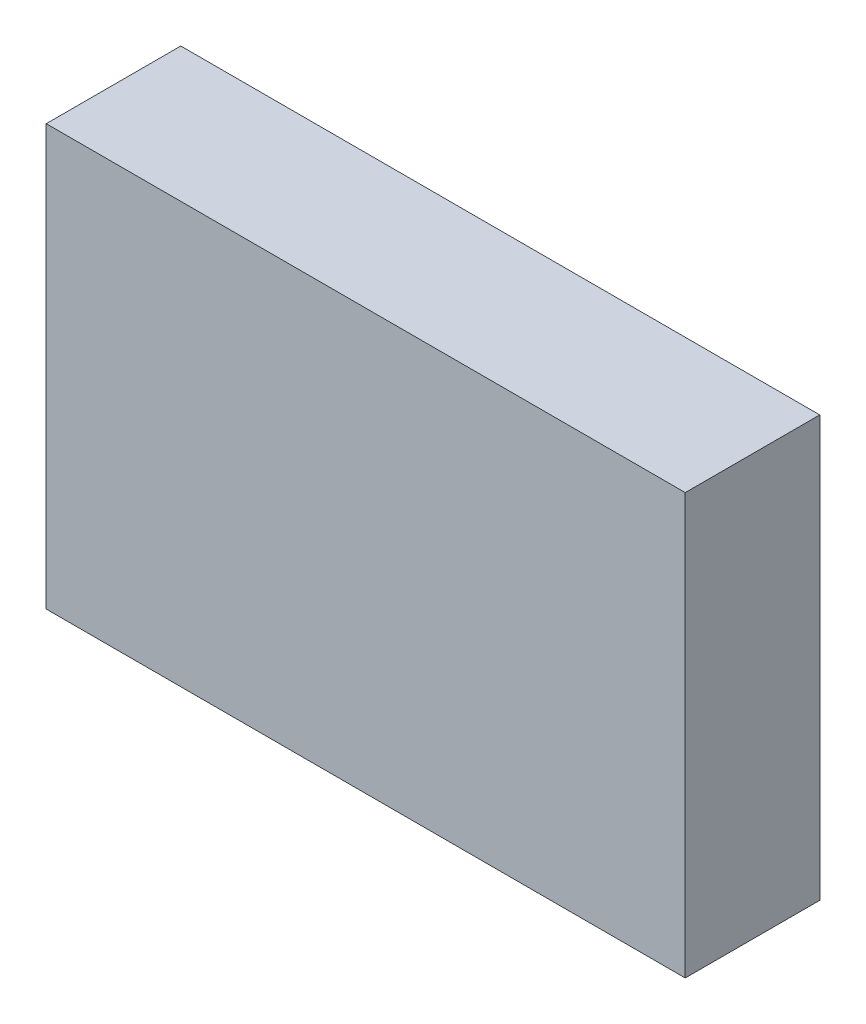
ISO-10303-21;
HEADER;
FILE_DESCRIPTION(('STEP AP214'),'2;1');
FILE_NAME('part.step','',(''),(''),'','','');
FILE_SCHEMA(('AUTOMOTIVE_DESIGN { 1 0 10303 214 1 1 1 1 }'));
ENDSEC;
DATA;
#1=APPLICATION_CONTEXT('core data for automotive mechanical design processes');
#2=APPLICATION_PROTOCOL_DEFINITION('international standard','automotive_design',2000,#1);
#3=PRODUCT_CONTEXT('',#1,'mechanical');
#4=PRODUCT('Part','Part','',(#3));
#5=PRODUCT_RELATED_PRODUCT_CATEGORY('part','',(#4));
#6=PRODUCT_DEFINITION_FORMATION('','',#4);
#7=PRODUCT_DEFINITION_CONTEXT('part definition',#1,'design');
#8=PRODUCT_DEFINITION('design','',#6,#7);
#9=PRODUCT_DEFINITION_SHAPE('','',#8);
#10=(LENGTH_UNIT() NAMED_UNIT(*) SI_UNIT(.MILLI.,.METRE.));
#11=(NAMED_UNIT(*) PLANE_ANGLE_UNIT() SI_UNIT($,.RADIAN.));
#12=(NAMED_UNIT(*) SI_UNIT($,.STERADIAN.) SOLID_ANGLE_UNIT());
#13=UNCERTAINTY_MEASURE_WITH_UNIT(LENGTH_MEASURE(1.E-05),#10,'distance_accuracy_value','');
#14=(GEOMETRIC_REPRESENTATION_CONTEXT(3) GLOBAL_UNCERTAINTY_ASSIGNED_CONTEXT((#13)) GLOBAL_UNIT_ASSIGNED_CONTEXT((#10,
#11,#12)) REPRESENTATION_CONTEXT('',''));
#15=CARTESIAN_POINT('',(0.,0.,0.));
#16=DIRECTION('',(0.,0.,1.));
#17=DIRECTION('',(1.,0.,0.));
#18=AXIS2_PLACEMENT_3D('',#15,#16,#17);
#19=CARTESIAN_POINT('',(0.95,-0.625,0.));
#20=DIRECTION('',(1.,0.,0.));
#21=DIRECTION('',(0.,1.,0.));
#22=AXIS2_PLACEMENT_3D('',#19,#20,#21);
#23=PLANE('',#22);
#24=DIRECTION('',(0.,-1.,0.));
#25=VECTOR('',#24,1.);
#26=CARTESIAN_POINT('',(0.95,0.625,0.));
#27=LINE('',#26,#25);
#28=CARTESIAN_POINT('',(0.95,0.625,0.));
#29=VERTEX_POINT('',#28);
#30=CARTESIAN_POINT('',(0.95,-0.625,0.));
#31=VERTEX_POINT('',#30);
#32=EDGE_CURVE('E11',#29,#31,#27,.T.);
#33=ORIENTED_EDGE('',*,*,#32,.F.);
#34=DIRECTION('',(0.,0.,1.));
#35=VECTOR('',#34,1.);
#36=CARTESIAN_POINT('',(0.95,0.625,0.));
#37=LINE('',#36,#35);
#38=CARTESIAN_POINT('',(0.95,0.625,0.4));
#39=VERTEX_POINT('',#38);
#40=EDGE_CURVE('E88',#29,#39,#37,.T.);
#41=ORIENTED_EDGE('',*,*,#40,.T.);
#42=DIRECTION('',(0.,1.,0.));
#43=VECTOR('',#42,1.);
#44=CARTESIAN_POINT('',(0.95,-0.625,0.4));
#45=LINE('',#44,#43);
#46=CARTESIAN_POINT('',(0.95,-0.625,0.4));
#47=VERTEX_POINT('',#46);
#48=EDGE_CURVE('E77',#47,#39,#45,.T.);
#49=ORIENTED_EDGE('',*,*,#48,.F.);
#50=DIRECTION('',(0.,0.,1.));
#51=VECTOR('',#50,1.);
#52=CARTESIAN_POINT('',(0.95,-0.625,0.));
#53=LINE('',#52,#51);
#54=EDGE_CURVE('E84',#31,#47,#53,.T.);
#55=ORIENTED_EDGE('',*,*,#54,.F.);
#56=EDGE_LOOP('',(#33,#41,#49,#55));
#57=FACE_BOUND('',#56,.T.);
#58=ADVANCED_FACE('F17',(#57),#23,.T.);
#59=CARTESIAN_POINT('',(-0.95,-0.625,0.));
#60=DIRECTION('',(0.,-1.,0.));
#61=DIRECTION('',(1.,0.,0.));
#62=AXIS2_PLACEMENT_3D('',#59,#60,#61);
#63=PLANE('',#62);
#64=DIRECTION('',(-1.,0.,0.));
#65=VECTOR('',#64,1.);
#66=CARTESIAN_POINT('',(0.95,-0.625,0.));
#67=LINE('',#66,#65);
#68=CARTESIAN_POINT('',(-0.95,-0.625,0.));
#69=VERTEX_POINT('',#68);
#70=EDGE_CURVE('E24',#31,#69,#67,.T.);
#71=ORIENTED_EDGE('',*,*,#70,.F.);
#72=ORIENTED_EDGE('',*,*,#54,.T.);
#73=DIRECTION('',(1.,0.,0.));
#74=VECTOR('',#73,1.);
#75=CARTESIAN_POINT('',(-0.95,-0.625,0.4));
#76=LINE('',#75,#74);
#77=CARTESIAN_POINT('',(-0.95,-0.625,0.4));
#78=VERTEX_POINT('',#77);
#79=EDGE_CURVE('E65',#78,#47,#76,.T.);
#80=ORIENTED_EDGE('',*,*,#79,.F.);
#81=DIRECTION('',(0.,0.,1.));
#82=VECTOR('',#81,1.);
#83=CARTESIAN_POINT('',(-0.95,-0.625,0.));
#84=LINE('',#83,#82);
#85=EDGE_CURVE('E70',#69,#78,#84,.T.);
#86=ORIENTED_EDGE('',*,*,#85,.F.);
#87=EDGE_LOOP('',(#71,#72,#80,#86));
#88=FACE_BOUND('',#87,.T.);
#89=ADVANCED_FACE('F91',(#88),#63,.T.);
#90=CARTESIAN_POINT('',(-0.95,0.625,0.));
#91=DIRECTION('',(-1.,0.,0.));
#92=DIRECTION('',(0.,-1.,0.));
#93=AXIS2_PLACEMENT_3D('',#90,#91,#92);
#94=PLANE('',#93);
#95=DIRECTION('',(0.,1.,0.));
#96=VECTOR('',#95,1.);
#97=CARTESIAN_POINT('',(-0.95,-0.625,0.));
#98=LINE('',#97,#96);
#99=CARTESIAN_POINT('',(-0.95,0.625,0.));
#100=VERTEX_POINT('',#99);
#101=EDGE_CURVE('E86',#69,#100,#98,.T.);
#102=ORIENTED_EDGE('',*,*,#101,.F.);
#103=ORIENTED_EDGE('',*,*,#85,.T.);
#104=DIRECTION('',(0.,-1.,0.));
#105=VECTOR('',#104,1.);
#106=CARTESIAN_POINT('',(-0.95,0.625,0.4));
#107=LINE('',#106,#105);
#108=CARTESIAN_POINT('',(-0.95,0.625,0.4));
#109=VERTEX_POINT('',#108);
#110=EDGE_CURVE('E66',#109,#78,#107,.T.);
#111=ORIENTED_EDGE('',*,*,#110,.F.);
#112=DIRECTION('',(0.,0.,1.));
#113=VECTOR('',#112,1.);
#114=CARTESIAN_POINT('',(-0.95,0.625,0.));
#115=LINE('',#114,#113);
#116=EDGE_CURVE('E55',#100,#109,#115,.T.);
#117=ORIENTED_EDGE('',*,*,#116,.F.);
#118=EDGE_LOOP('',(#102,#103,#111,#117));
#119=FACE_BOUND('',#118,.T.);
#120=ADVANCED_FACE('F69',(#119),#94,.T.);
#121=CARTESIAN_POINT('',(0.95,0.625,0.));
#122=DIRECTION('',(0.,1.,0.));
#123=DIRECTION('',(-1.,0.,0.));
#124=AXIS2_PLACEMENT_3D('',#121,#122,#123);
#125=PLANE('',#124);
#126=DIRECTION('',(1.,0.,0.));
#127=VECTOR('',#126,1.);
#128=CARTESIAN_POINT('',(-0.95,0.625,0.));
#129=LINE('',#128,#127);
#130=EDGE_CURVE('E62',#100,#29,#129,.T.);
#131=ORIENTED_EDGE('',*,*,#130,.F.);
#132=ORIENTED_EDGE('',*,*,#116,.T.);
#133=DIRECTION('',(-1.,0.,0.));
#134=VECTOR('',#133,1.);
#135=CARTESIAN_POINT('',(0.95,0.625,0.4));
#136=LINE('',#135,#134);
#137=EDGE_CURVE('E60',#39,#109,#136,.T.);
#138=ORIENTED_EDGE('',*,*,#137,.F.);
#139=ORIENTED_EDGE('',*,*,#40,.F.);
#140=EDGE_LOOP('',(#131,#132,#138,#139));
#141=FACE_BOUND('',#140,.T.);
#142=ADVANCED_FACE('F57',(#141),#125,.T.);
#143=CARTESIAN_POINT('',(0.,0.,0.));
#144=DIRECTION('',(0.,0.,1.));
#145=DIRECTION('',(1.,0.,0.));
#146=AXIS2_PLACEMENT_3D('',#143,#144,#145);
#147=PLANE('',#146);
#148=ORIENTED_EDGE('',*,*,#130,.T.);
#149=ORIENTED_EDGE('',*,*,#32,.T.);
#150=ORIENTED_EDGE('',*,*,#70,.T.);
#151=ORIENTED_EDGE('',*,*,#101,.T.);
#152=EDGE_LOOP('',(#148,#149,#150,#151));
#153=FACE_BOUND('',#152,.T.);
#154=ADVANCED_FACE('F90',(#153),#147,.F.);
#155=CARTESIAN_POINT('',(0.,0.,0.4));
#156=DIRECTION('',(0.,0.,1.));
#157=DIRECTION('',(1.,0.,0.));
#158=AXIS2_PLACEMENT_3D('',#155,#156,#157);
#159=PLANE('',#158);
#160=ORIENTED_EDGE('',*,*,#137,.T.);
#161=ORIENTED_EDGE('',*,*,#110,.T.);
#162=ORIENTED_EDGE('',*,*,#79,.T.);
#163=ORIENTED_EDGE('',*,*,#48,.T.);
#164=EDGE_LOOP('',(#160,#161,#162,#163));
#165=FACE_BOUND('',#164,.T.);
#166=ADVANCED_FACE('F75',(#165),#159,.T.);
#167=CLOSED_SHELL('',(#58,#89,#120,#142,#154,#166));
#168=MANIFOLD_SOLID_BREP('B1',#167);
#169=ADVANCED_BREP_SHAPE_REPRESENTATION('',(#18,#168),#14);
#170=SHAPE_DEFINITION_REPRESENTATION(#9,#169);
ENDSEC;
END-ISO-10303-21;
